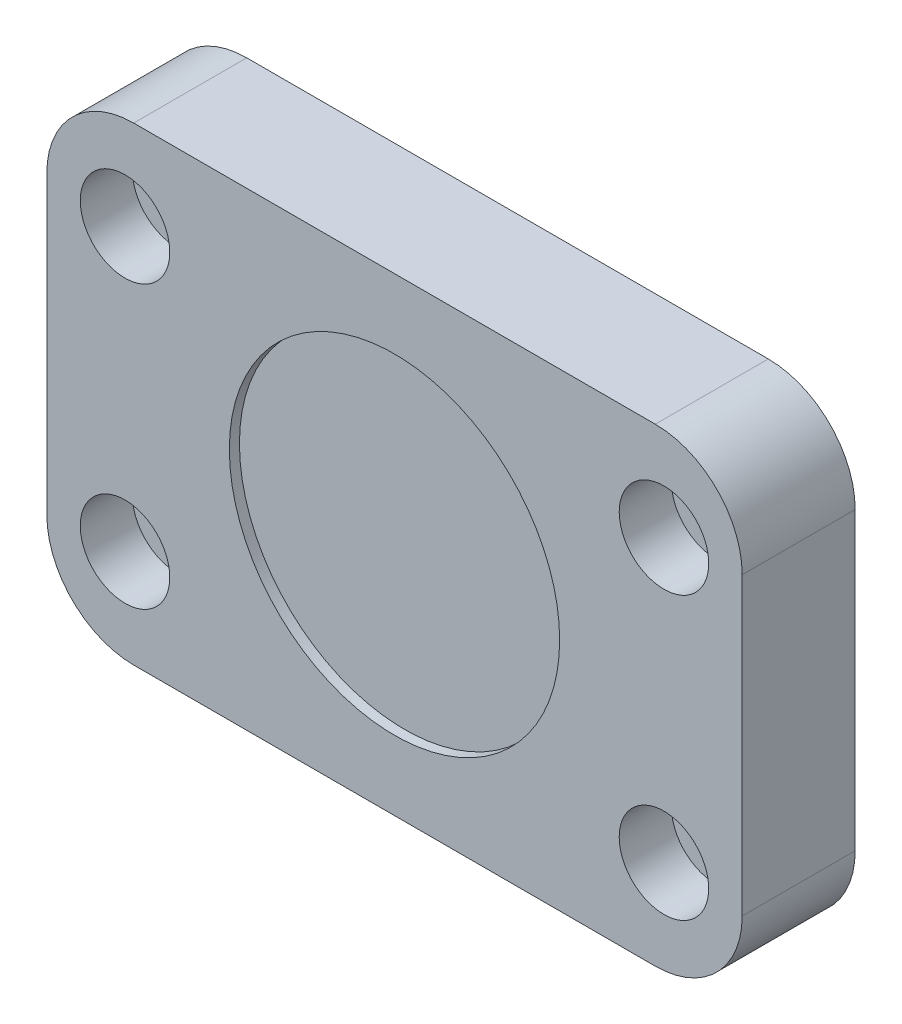
ISO-10303-21;
HEADER;
FILE_DESCRIPTION(('STEP AP214'),'2;1');
FILE_NAME('part.step','',(''),(''),'','','');
FILE_SCHEMA(('AUTOMOTIVE_DESIGN { 1 0 10303 214 1 1 1 1 }'));
ENDSEC;
DATA;
#1=APPLICATION_CONTEXT('core data for automotive mechanical design processes');
#2=APPLICATION_PROTOCOL_DEFINITION('international standard','automotive_design',2000,#1);
#3=PRODUCT_CONTEXT('',#1,'mechanical');
#4=PRODUCT('Part','Part','',(#3));
#5=PRODUCT_RELATED_PRODUCT_CATEGORY('part','',(#4));
#6=PRODUCT_DEFINITION_FORMATION('','',#4);
#7=PRODUCT_DEFINITION_CONTEXT('part definition',#1,'design');
#8=PRODUCT_DEFINITION('design','',#6,#7);
#9=PRODUCT_DEFINITION_SHAPE('','',#8);
#10=(LENGTH_UNIT() NAMED_UNIT(*) SI_UNIT(.MILLI.,.METRE.));
#11=(NAMED_UNIT(*) PLANE_ANGLE_UNIT() SI_UNIT($,.RADIAN.));
#12=(NAMED_UNIT(*) SI_UNIT($,.STERADIAN.) SOLID_ANGLE_UNIT());
#13=UNCERTAINTY_MEASURE_WITH_UNIT(LENGTH_MEASURE(1.E-05),#10,'distance_accuracy_value','');
#14=(GEOMETRIC_REPRESENTATION_CONTEXT(3) GLOBAL_UNCERTAINTY_ASSIGNED_CONTEXT((#13)) GLOBAL_UNIT_ASSIGNED_CONTEXT((#10,
#11,#12)) REPRESENTATION_CONTEXT('',''));
#15=CARTESIAN_POINT('',(0.,0.,0.));
#16=DIRECTION('',(0.,0.,1.));
#17=DIRECTION('',(1.,0.,0.));
#18=AXIS2_PLACEMENT_3D('',#15,#16,#17);
#19=CARTESIAN_POINT('',(0.,29.,50.84));
#20=DIRECTION('',(0.,0.,1.));
#21=DIRECTION('',(1.,0.,0.));
#22=AXIS2_PLACEMENT_3D('',#19,#20,#21);
#23=PLANE('',#22);
#24=CARTESIAN_POINT('',(0.,29.,50.84));
#25=DIRECTION('',(0.,0.,1.));
#26=DIRECTION('',(1.,0.,0.));
#27=AXIS2_PLACEMENT_3D('',#24,#25,#26);
#28=CIRCLE('',#27,19.);
#29=CARTESIAN_POINT('',(19.,29.,50.84));
#30=VERTEX_POINT('',#29);
#31=EDGE_CURVE('E19',#30,#30,#28,.T.);
#32=ORIENTED_EDGE('',*,*,#31,.T.);
#33=EDGE_LOOP('',(#32));
#34=FACE_BOUND('',#33,.T.);
#35=ADVANCED_FACE('F16',(#34),#23,.T.);
#36=CARTESIAN_POINT('',(0.,29.,50.84));
#37=DIRECTION('',(0.,0.,1.));
#38=DIRECTION('',(1.,0.,0.));
#39=AXIS2_PLACEMENT_3D('',#36,#37,#38);
#40=CYLINDRICAL_SURFACE('',#39,19.);
#41=CARTESIAN_POINT('',(0.,29.,52.));
#42=DIRECTION('',(0.,0.,1.));
#43=DIRECTION('',(1.,0.,0.));
#44=AXIS2_PLACEMENT_3D('',#41,#42,#43);
#45=CIRCLE('',#44,19.);
#46=CARTESIAN_POINT('',(19.,29.,52.));
#47=VERTEX_POINT('',#46);
#48=EDGE_CURVE('E180',#47,#47,#45,.F.);
#49=ORIENTED_EDGE('',*,*,#48,.F.);
#50=EDGE_LOOP('',(#49));
#51=FACE_BOUND('',#50,.T.);
#52=ORIENTED_EDGE('',*,*,#31,.F.);
#53=EDGE_LOOP('',(#52));
#54=FACE_BOUND('',#53,.T.);
#55=ADVANCED_FACE('F188',(#51,#54),#40,.F.);
#56=CARTESIAN_POINT('',(-31.,45.2,49.));
#57=DIRECTION('',(0.,0.,-1.));
#58=DIRECTION('',(-1.,0.,0.));
#59=AXIS2_PLACEMENT_3D('',#56,#57,#58);
#60=CYLINDRICAL_SURFACE('',#59,5.15);
#61=CARTESIAN_POINT('',(-31.,45.2,46.));
#62=DIRECTION('',(0.,0.,-1.));
#63=DIRECTION('',(-1.,0.,0.));
#64=AXIS2_PLACEMENT_3D('',#61,#62,#63);
#65=CIRCLE('',#64,5.15);
#66=CARTESIAN_POINT('',(-36.15,45.2,46.));
#67=VERTEX_POINT('',#66);
#68=EDGE_CURVE('E166',#67,#67,#65,.T.);
#69=ORIENTED_EDGE('',*,*,#68,.T.);
#70=EDGE_LOOP('',(#69));
#71=FACE_BOUND('',#70,.T.);
#72=CARTESIAN_POINT('',(-31.,45.2,52.));
#73=DIRECTION('',(0.,0.,-1.));
#74=DIRECTION('',(-1.,0.,0.));
#75=AXIS2_PLACEMENT_3D('',#72,#73,#74);
#76=CIRCLE('',#75,5.15);
#77=CARTESIAN_POINT('',(-36.15,45.2,52.));
#78=VERTEX_POINT('',#77);
#79=EDGE_CURVE('E178',#78,#78,#76,.T.);
#80=ORIENTED_EDGE('',*,*,#79,.F.);
#81=EDGE_LOOP('',(#80));
#82=FACE_BOUND('',#81,.T.);
#83=ADVANCED_FACE('F190',(#71,#82),#60,.F.);
#84=CARTESIAN_POINT('',(31.,45.2,49.));
#85=DIRECTION('',(0.,0.,-1.));
#86=DIRECTION('',(-1.,0.,0.));
#87=AXIS2_PLACEMENT_3D('',#84,#85,#86);
#88=CYLINDRICAL_SURFACE('',#87,5.15);
#89=CARTESIAN_POINT('',(31.,45.2,46.));
#90=DIRECTION('',(0.,0.,-1.));
#91=DIRECTION('',(-1.,0.,0.));
#92=AXIS2_PLACEMENT_3D('',#89,#90,#91);
#93=CIRCLE('',#92,5.15);
#94=CARTESIAN_POINT('',(25.85,45.2,46.));
#95=VERTEX_POINT('',#94);
#96=EDGE_CURVE('E163',#95,#95,#93,.T.);
#97=ORIENTED_EDGE('',*,*,#96,.T.);
#98=EDGE_LOOP('',(#97));
#99=FACE_BOUND('',#98,.T.);
#100=CARTESIAN_POINT('',(31.,45.2,52.));
#101=DIRECTION('',(0.,0.,-1.));
#102=DIRECTION('',(-1.,0.,0.));
#103=AXIS2_PLACEMENT_3D('',#100,#101,#102);
#104=CIRCLE('',#103,5.15);
#105=CARTESIAN_POINT('',(25.85,45.2,52.));
#106=VERTEX_POINT('',#105);
#107=EDGE_CURVE('E175',#106,#106,#104,.T.);
#108=ORIENTED_EDGE('',*,*,#107,.F.);
#109=EDGE_LOOP('',(#108));
#110=FACE_BOUND('',#109,.T.);
#111=ADVANCED_FACE('F197',(#99,#110),#88,.F.);
#112=CARTESIAN_POINT('',(31.,12.8,49.));
#113=DIRECTION('',(0.,0.,-1.));
#114=DIRECTION('',(-1.,0.,0.));
#115=AXIS2_PLACEMENT_3D('',#112,#113,#114);
#116=CYLINDRICAL_SURFACE('',#115,5.15);
#117=CARTESIAN_POINT('',(31.,12.8,46.));
#118=DIRECTION('',(0.,0.,-1.));
#119=DIRECTION('',(-1.,0.,0.));
#120=AXIS2_PLACEMENT_3D('',#117,#118,#119);
#121=CIRCLE('',#120,5.15);
#122=CARTESIAN_POINT('',(25.85,12.8,46.));
#123=VERTEX_POINT('',#122);
#124=EDGE_CURVE('E160',#123,#123,#121,.T.);
#125=ORIENTED_EDGE('',*,*,#124,.T.);
#126=EDGE_LOOP('',(#125));
#127=FACE_BOUND('',#126,.T.);
#128=CARTESIAN_POINT('',(31.,12.8,52.));
#129=DIRECTION('',(0.,0.,-1.));
#130=DIRECTION('',(-1.,0.,0.));
#131=AXIS2_PLACEMENT_3D('',#128,#129,#130);
#132=CIRCLE('',#131,5.15);
#133=CARTESIAN_POINT('',(25.85,12.8,52.));
#134=VERTEX_POINT('',#133);
#135=EDGE_CURVE('E172',#134,#134,#132,.T.);
#136=ORIENTED_EDGE('',*,*,#135,.F.);
#137=EDGE_LOOP('',(#136));
#138=FACE_BOUND('',#137,.T.);
#139=ADVANCED_FACE('F274',(#127,#138),#116,.F.);
#140=CARTESIAN_POINT('',(-31.,12.8,49.));
#141=DIRECTION('',(0.,0.,-1.));
#142=DIRECTION('',(-1.,0.,0.));
#143=AXIS2_PLACEMENT_3D('',#140,#141,#142);
#144=CYLINDRICAL_SURFACE('',#143,5.15);
#145=CARTESIAN_POINT('',(-31.,12.8,46.));
#146=DIRECTION('',(0.,0.,-1.));
#147=DIRECTION('',(-1.,0.,0.));
#148=AXIS2_PLACEMENT_3D('',#145,#146,#147);
#149=CIRCLE('',#148,5.15);
#150=CARTESIAN_POINT('',(-36.15,12.8,46.));
#151=VERTEX_POINT('',#150);
#152=EDGE_CURVE('E99',#151,#151,#149,.T.);
#153=ORIENTED_EDGE('',*,*,#152,.T.);
#154=EDGE_LOOP('',(#153));
#155=FACE_BOUND('',#154,.T.);
#156=CARTESIAN_POINT('',(-31.,12.8,52.));
#157=DIRECTION('',(0.,0.,-1.));
#158=DIRECTION('',(-1.,0.,0.));
#159=AXIS2_PLACEMENT_3D('',#156,#157,#158);
#160=CIRCLE('',#159,5.15);
#161=CARTESIAN_POINT('',(-36.15,12.8,52.));
#162=VERTEX_POINT('',#161);
#163=EDGE_CURVE('E169',#162,#162,#160,.T.);
#164=ORIENTED_EDGE('',*,*,#163,.F.);
#165=EDGE_LOOP('',(#164));
#166=FACE_BOUND('',#165,.T.);
#167=ADVANCED_FACE('F270',(#155,#166),#144,.F.);
#168=CARTESIAN_POINT('',(0.,29.,52.));
#169=DIRECTION('',(0.,0.,1.));
#170=DIRECTION('',(1.,0.,0.));
#171=AXIS2_PLACEMENT_3D('',#168,#169,#170);
#172=PLANE('',#171);
#173=ORIENTED_EDGE('',*,*,#163,.T.);
#174=EDGE_LOOP('',(#173));
#175=FACE_BOUND('',#174,.T.);
#176=ORIENTED_EDGE('',*,*,#135,.T.);
#177=EDGE_LOOP('',(#176));
#178=FACE_BOUND('',#177,.T.);
#179=ORIENTED_EDGE('',*,*,#107,.T.);
#180=EDGE_LOOP('',(#179));
#181=FACE_BOUND('',#180,.T.);
#182=ORIENTED_EDGE('',*,*,#79,.T.);
#183=EDGE_LOOP('',(#182));
#184=FACE_BOUND('',#183,.T.);
#185=ORIENTED_EDGE('',*,*,#48,.T.);
#186=EDGE_LOOP('',(#185));
#187=FACE_BOUND('',#186,.T.);
#188=DIRECTION('',(0.,1.,0.));
#189=VECTOR('',#188,1.);
#190=CARTESIAN_POINT('',(40.,12.,52.));
#191=LINE('',#190,#189);
#192=CARTESIAN_POINT('',(40.,46.,52.));
#193=VERTEX_POINT('',#192);
#194=CARTESIAN_POINT('',(40.,12.,52.));
#195=VERTEX_POINT('',#194);
#196=EDGE_CURVE('E112',#193,#195,#191,.F.);
#197=ORIENTED_EDGE('',*,*,#196,.F.);
#198=CARTESIAN_POINT('',(30.,46.,52.));
#199=DIRECTION('',(0.,0.,1.));
#200=DIRECTION('',(1.,0.,0.));
#201=AXIS2_PLACEMENT_3D('',#198,#199,#200);
#202=CIRCLE('',#201,10.);
#203=CARTESIAN_POINT('',(30.,56.,52.));
#204=VERTEX_POINT('',#203);
#205=EDGE_CURVE('E153',#204,#193,#202,.F.);
#206=ORIENTED_EDGE('',*,*,#205,.F.);
#207=DIRECTION('',(-1.,0.,0.));
#208=VECTOR('',#207,1.);
#209=CARTESIAN_POINT('',(30.,56.,52.));
#210=LINE('',#209,#208);
#211=CARTESIAN_POINT('',(-30.,56.,52.));
#212=VERTEX_POINT('',#211);
#213=EDGE_CURVE('E95',#212,#204,#210,.F.);
#214=ORIENTED_EDGE('',*,*,#213,.F.);
#215=CARTESIAN_POINT('',(-30.,46.,52.));
#216=DIRECTION('',(0.,0.,1.));
#217=DIRECTION('',(1.,0.,0.));
#218=AXIS2_PLACEMENT_3D('',#215,#216,#217);
#219=CIRCLE('',#218,10.);
#220=CARTESIAN_POINT('',(-40.,46.,52.));
#221=VERTEX_POINT('',#220);
#222=EDGE_CURVE('E88',#221,#212,#219,.F.);
#223=ORIENTED_EDGE('',*,*,#222,.F.);
#224=DIRECTION('',(0.,-1.,0.));
#225=VECTOR('',#224,1.);
#226=CARTESIAN_POINT('',(-40.,46.,52.));
#227=LINE('',#226,#225);
#228=CARTESIAN_POINT('',(-40.,12.,52.));
#229=VERTEX_POINT('',#228);
#230=EDGE_CURVE('E78',#229,#221,#227,.F.);
#231=ORIENTED_EDGE('',*,*,#230,.F.);
#232=CARTESIAN_POINT('',(-30.,12.,52.));
#233=DIRECTION('',(0.,0.,1.));
#234=DIRECTION('',(1.,0.,0.));
#235=AXIS2_PLACEMENT_3D('',#232,#233,#234);
#236=CIRCLE('',#235,10.);
#237=CARTESIAN_POINT('',(-30.,2.00000000000001,52.));
#238=VERTEX_POINT('',#237);
#239=EDGE_CURVE('E104',#238,#229,#236,.F.);
#240=ORIENTED_EDGE('',*,*,#239,.F.);
#241=DIRECTION('',(1.,0.,0.));
#242=VECTOR('',#241,1.);
#243=CARTESIAN_POINT('',(-30.,2.00000000000001,52.));
#244=LINE('',#243,#242);
#245=CARTESIAN_POINT('',(30.,2.00000000000001,52.));
#246=VERTEX_POINT('',#245);
#247=EDGE_CURVE('E116',#246,#238,#244,.F.);
#248=ORIENTED_EDGE('',*,*,#247,.F.);
#249=CARTESIAN_POINT('',(30.,12.,52.));
#250=DIRECTION('',(0.,0.,1.));
#251=DIRECTION('',(1.,0.,0.));
#252=AXIS2_PLACEMENT_3D('',#249,#250,#251);
#253=CIRCLE('',#252,10.);
#254=EDGE_CURVE('E156',#195,#246,#253,.F.);
#255=ORIENTED_EDGE('',*,*,#254,.F.);
#256=EDGE_LOOP('',(#197,#206,#214,#223,#231,#240,#248,#255));
#257=FACE_BOUND('',#256,.T.);
#258=ADVANCED_FACE('F93',(#175,#178,#181,#184,#187,#257),#172,.T.);
#259=CARTESIAN_POINT('',(-31.,45.2,46.));
#260=DIRECTION('',(0.,0.,-1.));
#261=DIRECTION('',(-1.,0.,0.));
#262=AXIS2_PLACEMENT_3D('',#259,#260,#261);
#263=PLANE('',#262);
#264=CARTESIAN_POINT('',(-31.,45.2,46.));
#265=DIRECTION('',(0.,0.,-1.));
#266=DIRECTION('',(-1.,0.,0.));
#267=AXIS2_PLACEMENT_3D('',#264,#265,#266);
#268=CIRCLE('',#267,3.3);
#269=CARTESIAN_POINT('',(-34.3,45.2,46.));
#270=VERTEX_POINT('',#269);
#271=EDGE_CURVE('E150',#270,#270,#268,.T.);
#272=ORIENTED_EDGE('',*,*,#271,.T.);
#273=EDGE_LOOP('',(#272));
#274=FACE_BOUND('',#273,.T.);
#275=ORIENTED_EDGE('',*,*,#68,.F.);
#276=EDGE_LOOP('',(#275));
#277=FACE_BOUND('',#276,.T.);
#278=ADVANCED_FACE('F263',(#274,#277),#263,.F.);
#279=CARTESIAN_POINT('',(31.,45.2,46.));
#280=DIRECTION('',(0.,0.,-1.));
#281=DIRECTION('',(-1.,0.,0.));
#282=AXIS2_PLACEMENT_3D('',#279,#280,#281);
#283=PLANE('',#282);
#284=CARTESIAN_POINT('',(31.,45.2,46.));
#285=DIRECTION('',(0.,0.,-1.));
#286=DIRECTION('',(-1.,0.,0.));
#287=AXIS2_PLACEMENT_3D('',#284,#285,#286);
#288=CIRCLE('',#287,3.3);
#289=CARTESIAN_POINT('',(27.7,45.2,46.));
#290=VERTEX_POINT('',#289);
#291=EDGE_CURVE('E147',#290,#290,#288,.T.);
#292=ORIENTED_EDGE('',*,*,#291,.T.);
#293=EDGE_LOOP('',(#292));
#294=FACE_BOUND('',#293,.T.);
#295=ORIENTED_EDGE('',*,*,#96,.F.);
#296=EDGE_LOOP('',(#295));
#297=FACE_BOUND('',#296,.T.);
#298=ADVANCED_FACE('F259',(#294,#297),#283,.F.);
#299=CARTESIAN_POINT('',(31.,12.8,46.));
#300=DIRECTION('',(0.,0.,-1.));
#301=DIRECTION('',(-1.,0.,0.));
#302=AXIS2_PLACEMENT_3D('',#299,#300,#301);
#303=PLANE('',#302);
#304=CARTESIAN_POINT('',(31.,12.8,46.));
#305=DIRECTION('',(0.,0.,-1.));
#306=DIRECTION('',(-1.,0.,0.));
#307=AXIS2_PLACEMENT_3D('',#304,#305,#306);
#308=CIRCLE('',#307,3.3);
#309=CARTESIAN_POINT('',(27.7,12.8,46.));
#310=VERTEX_POINT('',#309);
#311=EDGE_CURVE('E144',#310,#310,#308,.T.);
#312=ORIENTED_EDGE('',*,*,#311,.T.);
#313=EDGE_LOOP('',(#312));
#314=FACE_BOUND('',#313,.T.);
#315=ORIENTED_EDGE('',*,*,#124,.F.);
#316=EDGE_LOOP('',(#315));
#317=FACE_BOUND('',#316,.T.);
#318=ADVANCED_FACE('F255',(#314,#317),#303,.F.);
#319=CARTESIAN_POINT('',(-31.,12.8,46.));
#320=DIRECTION('',(0.,0.,-1.));
#321=DIRECTION('',(-1.,0.,0.));
#322=AXIS2_PLACEMENT_3D('',#319,#320,#321);
#323=PLANE('',#322);
#324=CARTESIAN_POINT('',(-31.,12.8,46.));
#325=DIRECTION('',(0.,0.,-1.));
#326=DIRECTION('',(-1.,0.,0.));
#327=AXIS2_PLACEMENT_3D('',#324,#325,#326);
#328=CIRCLE('',#327,3.3);
#329=CARTESIAN_POINT('',(-34.3,12.8,46.));
#330=VERTEX_POINT('',#329);
#331=EDGE_CURVE('E141',#330,#330,#328,.T.);
#332=ORIENTED_EDGE('',*,*,#331,.T.);
#333=EDGE_LOOP('',(#332));
#334=FACE_BOUND('',#333,.T.);
#335=ORIENTED_EDGE('',*,*,#152,.F.);
#336=EDGE_LOOP('',(#335));
#337=FACE_BOUND('',#336,.T.);
#338=ADVANCED_FACE('F252',(#334,#337),#323,.F.);
#339=CARTESIAN_POINT('',(-30.,46.,39.));
#340=DIRECTION('',(0.,0.,1.));
#341=DIRECTION('',(1.,0.,0.));
#342=AXIS2_PLACEMENT_3D('',#339,#340,#341);
#343=CYLINDRICAL_SURFACE('',#342,10.);
#344=ORIENTED_EDGE('',*,*,#222,.T.);
#345=DIRECTION('',(0.,0.,1.));
#346=VECTOR('',#345,1.);
#347=CARTESIAN_POINT('',(-30.,56.,39.));
#348=LINE('',#347,#346);
#349=CARTESIAN_POINT('',(-30.,56.,39.));
#350=VERTEX_POINT('',#349);
#351=EDGE_CURVE('E111',#350,#212,#348,.T.);
#352=ORIENTED_EDGE('',*,*,#351,.F.);
#353=CARTESIAN_POINT('',(-30.,46.,39.));
#354=DIRECTION('',(0.,0.,1.));
#355=DIRECTION('',(1.,0.,0.));
#356=AXIS2_PLACEMENT_3D('',#353,#354,#355);
#357=CIRCLE('',#356,10.);
#358=CARTESIAN_POINT('',(-40.,46.,39.));
#359=VERTEX_POINT('',#358);
#360=EDGE_CURVE('E103',#350,#359,#357,.T.);
#361=ORIENTED_EDGE('',*,*,#360,.T.);
#362=DIRECTION('',(0.,0.,1.));
#363=VECTOR('',#362,1.);
#364=CARTESIAN_POINT('',(-40.,46.,39.));
#365=LINE('',#364,#363);
#366=EDGE_CURVE('E83',#221,#359,#365,.F.);
#367=ORIENTED_EDGE('',*,*,#366,.F.);
#368=EDGE_LOOP('',(#344,#352,#361,#367));
#369=FACE_BOUND('',#368,.T.);
#370=ADVANCED_FACE('F102',(#369),#343,.T.);
#371=CARTESIAN_POINT('',(-40.,46.,39.));
#372=DIRECTION('',(-1.,0.,0.));
#373=DIRECTION('',(0.,-1.,0.));
#374=AXIS2_PLACEMENT_3D('',#371,#372,#373);
#375=PLANE('',#374);
#376=ORIENTED_EDGE('',*,*,#230,.T.);
#377=ORIENTED_EDGE('',*,*,#366,.T.);
#378=DIRECTION('',(0.,1.,0.));
#379=VECTOR('',#378,1.);
#380=CARTESIAN_POINT('',(-40.,29.,39.));
#381=LINE('',#380,#379);
#382=CARTESIAN_POINT('',(-40.,12.,39.));
#383=VERTEX_POINT('',#382);
#384=EDGE_CURVE('E139',#359,#383,#381,.F.);
#385=ORIENTED_EDGE('',*,*,#384,.T.);
#386=DIRECTION('',(0.,0.,1.));
#387=VECTOR('',#386,1.);
#388=CARTESIAN_POINT('',(-40.,12.,39.));
#389=LINE('',#388,#387);
#390=EDGE_CURVE('E85',#229,#383,#389,.F.);
#391=ORIENTED_EDGE('',*,*,#390,.F.);
#392=EDGE_LOOP('',(#376,#377,#385,#391));
#393=FACE_BOUND('',#392,.T.);
#394=ADVANCED_FACE('F80',(#393),#375,.T.);
#395=CARTESIAN_POINT('',(-30.,12.,39.));
#396=DIRECTION('',(0.,0.,1.));
#397=DIRECTION('',(1.,0.,0.));
#398=AXIS2_PLACEMENT_3D('',#395,#396,#397);
#399=CYLINDRICAL_SURFACE('',#398,10.);
#400=ORIENTED_EDGE('',*,*,#239,.T.);
#401=ORIENTED_EDGE('',*,*,#390,.T.);
#402=CARTESIAN_POINT('',(-30.,12.,39.));
#403=DIRECTION('',(0.,0.,1.));
#404=DIRECTION('',(1.,0.,0.));
#405=AXIS2_PLACEMENT_3D('',#402,#403,#404);
#406=CIRCLE('',#405,10.);
#407=CARTESIAN_POINT('',(-30.,2.,39.));
#408=VERTEX_POINT('',#407);
#409=EDGE_CURVE('E136',#383,#408,#406,.T.);
#410=ORIENTED_EDGE('',*,*,#409,.T.);
#411=DIRECTION('',(0.,0.,1.));
#412=VECTOR('',#411,1.);
#413=CARTESIAN_POINT('',(-30.,2.00000000000001,39.));
#414=LINE('',#413,#412);
#415=EDGE_CURVE('E117',#238,#408,#414,.F.);
#416=ORIENTED_EDGE('',*,*,#415,.F.);
#417=EDGE_LOOP('',(#400,#401,#410,#416));
#418=FACE_BOUND('',#417,.T.);
#419=ADVANCED_FACE('F243',(#418),#399,.T.);
#420=CARTESIAN_POINT('',(-30.,2.00000000000001,39.));
#421=DIRECTION('',(0.,-1.,0.));
#422=DIRECTION('',(1.,0.,0.));
#423=AXIS2_PLACEMENT_3D('',#420,#421,#422);
#424=PLANE('',#423);
#425=ORIENTED_EDGE('',*,*,#247,.T.);
#426=ORIENTED_EDGE('',*,*,#415,.T.);
#427=DIRECTION('',(1.,0.,0.));
#428=VECTOR('',#427,1.);
#429=CARTESIAN_POINT('',(0.,2.,39.));
#430=LINE('',#429,#428);
#431=CARTESIAN_POINT('',(30.,2.,39.));
#432=VERTEX_POINT('',#431);
#433=EDGE_CURVE('E135',#408,#432,#430,.T.);
#434=ORIENTED_EDGE('',*,*,#433,.T.);
#435=DIRECTION('',(0.,0.,1.));
#436=VECTOR('',#435,1.);
#437=CARTESIAN_POINT('',(30.,2.,39.));
#438=LINE('',#437,#436);
#439=EDGE_CURVE('E115',#246,#432,#438,.F.);
#440=ORIENTED_EDGE('',*,*,#439,.F.);
#441=EDGE_LOOP('',(#425,#426,#434,#440));
#442=FACE_BOUND('',#441,.T.);
#443=ADVANCED_FACE('F239',(#442),#424,.T.);
#444=CARTESIAN_POINT('',(30.,12.,39.));
#445=DIRECTION('',(0.,0.,1.));
#446=DIRECTION('',(1.,0.,0.));
#447=AXIS2_PLACEMENT_3D('',#444,#445,#446);
#448=CYLINDRICAL_SURFACE('',#447,10.);
#449=ORIENTED_EDGE('',*,*,#254,.T.);
#450=ORIENTED_EDGE('',*,*,#439,.T.);
#451=CARTESIAN_POINT('',(30.,12.,39.));
#452=DIRECTION('',(0.,0.,1.));
#453=DIRECTION('',(1.,0.,0.));
#454=AXIS2_PLACEMENT_3D('',#451,#452,#453);
#455=CIRCLE('',#454,10.);
#456=CARTESIAN_POINT('',(40.,12.,39.));
#457=VERTEX_POINT('',#456);
#458=EDGE_CURVE('E132',#432,#457,#455,.T.);
#459=ORIENTED_EDGE('',*,*,#458,.T.);
#460=DIRECTION('',(0.,0.,-1.));
#461=VECTOR('',#460,1.);
#462=CARTESIAN_POINT('',(40.,12.,39.));
#463=LINE('',#462,#461);
#464=EDGE_CURVE('E114',#195,#457,#463,.T.);
#465=ORIENTED_EDGE('',*,*,#464,.F.);
#466=EDGE_LOOP('',(#449,#450,#459,#465));
#467=FACE_BOUND('',#466,.T.);
#468=ADVANCED_FACE('F235',(#467),#448,.T.);
#469=CARTESIAN_POINT('',(40.,12.,39.));
#470=DIRECTION('',(1.,0.,0.));
#471=DIRECTION('',(0.,0.,-1.));
#472=AXIS2_PLACEMENT_3D('',#469,#470,#471);
#473=PLANE('',#472);
#474=ORIENTED_EDGE('',*,*,#196,.T.);
#475=ORIENTED_EDGE('',*,*,#464,.T.);
#476=DIRECTION('',(0.,1.,0.));
#477=VECTOR('',#476,1.);
#478=CARTESIAN_POINT('',(40.,29.,39.));
#479=LINE('',#478,#477);
#480=CARTESIAN_POINT('',(40.,46.,39.));
#481=VERTEX_POINT('',#480);
#482=EDGE_CURVE('E131',#457,#481,#479,.T.);
#483=ORIENTED_EDGE('',*,*,#482,.T.);
#484=DIRECTION('',(0.,0.,1.));
#485=VECTOR('',#484,1.);
#486=CARTESIAN_POINT('',(40.,46.,39.));
#487=LINE('',#486,#485);
#488=EDGE_CURVE('E155',#193,#481,#487,.F.);
#489=ORIENTED_EDGE('',*,*,#488,.F.);
#490=EDGE_LOOP('',(#474,#475,#483,#489));
#491=FACE_BOUND('',#490,.T.);
#492=ADVANCED_FACE('F231',(#491),#473,.T.);
#493=CARTESIAN_POINT('',(30.,46.,39.));
#494=DIRECTION('',(0.,0.,1.));
#495=DIRECTION('',(1.,0.,0.));
#496=AXIS2_PLACEMENT_3D('',#493,#494,#495);
#497=CYLINDRICAL_SURFACE('',#496,10.);
#498=ORIENTED_EDGE('',*,*,#205,.T.);
#499=ORIENTED_EDGE('',*,*,#488,.T.);
#500=CARTESIAN_POINT('',(30.,46.,39.));
#501=DIRECTION('',(0.,0.,1.));
#502=DIRECTION('',(1.,0.,0.));
#503=AXIS2_PLACEMENT_3D('',#500,#501,#502);
#504=CIRCLE('',#503,10.);
#505=CARTESIAN_POINT('',(30.,56.,39.));
#506=VERTEX_POINT('',#505);
#507=EDGE_CURVE('E128',#481,#506,#504,.T.);
#508=ORIENTED_EDGE('',*,*,#507,.T.);
#509=DIRECTION('',(0.,0.,1.));
#510=VECTOR('',#509,1.);
#511=CARTESIAN_POINT('',(30.,56.,39.));
#512=LINE('',#511,#510);
#513=EDGE_CURVE('E34',#204,#506,#512,.F.);
#514=ORIENTED_EDGE('',*,*,#513,.F.);
#515=EDGE_LOOP('',(#498,#499,#508,#514));
#516=FACE_BOUND('',#515,.T.);
#517=ADVANCED_FACE('F228',(#516),#497,.T.);
#518=CARTESIAN_POINT('',(30.,56.,39.));
#519=DIRECTION('',(0.,1.,0.));
#520=DIRECTION('',(-1.,0.,0.));
#521=AXIS2_PLACEMENT_3D('',#518,#519,#520);
#522=PLANE('',#521);
#523=ORIENTED_EDGE('',*,*,#213,.T.);
#524=ORIENTED_EDGE('',*,*,#513,.T.);
#525=DIRECTION('',(1.,0.,0.));
#526=VECTOR('',#525,1.);
#527=CARTESIAN_POINT('',(0.,56.,39.));
#528=LINE('',#527,#526);
#529=EDGE_CURVE('E127',#506,#350,#528,.F.);
#530=ORIENTED_EDGE('',*,*,#529,.T.);
#531=ORIENTED_EDGE('',*,*,#351,.T.);
#532=EDGE_LOOP('',(#523,#524,#530,#531));
#533=FACE_BOUND('',#532,.T.);
#534=ADVANCED_FACE('F224',(#533),#522,.T.);
#535=CARTESIAN_POINT('',(-31.,45.2,23.4));
#536=DIRECTION('',(0.,0.,-1.));
#537=DIRECTION('',(-1.,0.,0.));
#538=AXIS2_PLACEMENT_3D('',#535,#536,#537);
#539=CYLINDRICAL_SURFACE('',#538,3.3);
#540=CARTESIAN_POINT('',(-31.,45.2,39.));
#541=DIRECTION('',(0.,0.,-1.));
#542=DIRECTION('',(-1.,0.,0.));
#543=AXIS2_PLACEMENT_3D('',#540,#541,#542);
#544=CIRCLE('',#543,3.3);
#545=CARTESIAN_POINT('',(-34.3,45.2,39.));
#546=VERTEX_POINT('',#545);
#547=EDGE_CURVE('E124',#546,#546,#544,.T.);
#548=ORIENTED_EDGE('',*,*,#547,.T.);
#549=EDGE_LOOP('',(#548));
#550=FACE_BOUND('',#549,.T.);
#551=ORIENTED_EDGE('',*,*,#271,.F.);
#552=EDGE_LOOP('',(#551));
#553=FACE_BOUND('',#552,.T.);
#554=ADVANCED_FACE('F220',(#550,#553),#539,.F.);
#555=CARTESIAN_POINT('',(31.,45.2,23.4));
#556=DIRECTION('',(0.,0.,-1.));
#557=DIRECTION('',(-1.,0.,0.));
#558=AXIS2_PLACEMENT_3D('',#555,#556,#557);
#559=CYLINDRICAL_SURFACE('',#558,3.3);
#560=CARTESIAN_POINT('',(31.,45.2,39.));
#561=DIRECTION('',(0.,0.,-1.));
#562=DIRECTION('',(-1.,0.,0.));
#563=AXIS2_PLACEMENT_3D('',#560,#561,#562);
#564=CIRCLE('',#563,3.3);
#565=CARTESIAN_POINT('',(27.7,45.2,39.));
#566=VERTEX_POINT('',#565);
#567=EDGE_CURVE('E121',#566,#566,#564,.T.);
#568=ORIENTED_EDGE('',*,*,#567,.T.);
#569=EDGE_LOOP('',(#568));
#570=FACE_BOUND('',#569,.T.);
#571=ORIENTED_EDGE('',*,*,#291,.F.);
#572=EDGE_LOOP('',(#571));
#573=FACE_BOUND('',#572,.T.);
#574=ADVANCED_FACE('F216',(#570,#573),#559,.F.);
#575=CARTESIAN_POINT('',(31.,12.8,23.4));
#576=DIRECTION('',(0.,0.,-1.));
#577=DIRECTION('',(-1.,0.,0.));
#578=AXIS2_PLACEMENT_3D('',#575,#576,#577);
#579=CYLINDRICAL_SURFACE('',#578,3.3);
#580=CARTESIAN_POINT('',(31.,12.8,39.));
#581=DIRECTION('',(0.,0.,-1.));
#582=DIRECTION('',(-1.,0.,0.));
#583=AXIS2_PLACEMENT_3D('',#580,#581,#582);
#584=CIRCLE('',#583,3.3);
#585=CARTESIAN_POINT('',(27.7,12.8,39.));
#586=VERTEX_POINT('',#585);
#587=EDGE_CURVE('E25',#586,#586,#584,.T.);
#588=ORIENTED_EDGE('',*,*,#587,.T.);
#589=EDGE_LOOP('',(#588));
#590=FACE_BOUND('',#589,.T.);
#591=ORIENTED_EDGE('',*,*,#311,.F.);
#592=EDGE_LOOP('',(#591));
#593=FACE_BOUND('',#592,.T.);
#594=ADVANCED_FACE('F208',(#590,#593),#579,.F.);
#595=CARTESIAN_POINT('',(-31.,12.8,23.4));
#596=DIRECTION('',(0.,0.,-1.));
#597=DIRECTION('',(-1.,0.,0.));
#598=AXIS2_PLACEMENT_3D('',#595,#596,#597);
#599=CYLINDRICAL_SURFACE('',#598,3.3);
#600=CARTESIAN_POINT('',(-31.,12.8,39.));
#601=DIRECTION('',(0.,0.,-1.));
#602=DIRECTION('',(-1.,0.,0.));
#603=AXIS2_PLACEMENT_3D('',#600,#601,#602);
#604=CIRCLE('',#603,3.3);
#605=CARTESIAN_POINT('',(-34.3,12.8,39.));
#606=VERTEX_POINT('',#605);
#607=EDGE_CURVE('E11',#606,#606,#604,.T.);
#608=ORIENTED_EDGE('',*,*,#607,.T.);
#609=EDGE_LOOP('',(#608));
#610=FACE_BOUND('',#609,.T.);
#611=ORIENTED_EDGE('',*,*,#331,.F.);
#612=EDGE_LOOP('',(#611));
#613=FACE_BOUND('',#612,.T.);
#614=ADVANCED_FACE('F202',(#610,#613),#599,.F.);
#615=CARTESIAN_POINT('',(0.,29.,39.));
#616=DIRECTION('',(0.,0.,1.));
#617=DIRECTION('',(1.,0.,0.));
#618=AXIS2_PLACEMENT_3D('',#615,#616,#617);
#619=PLANE('',#618);
#620=ORIENTED_EDGE('',*,*,#607,.F.);
#621=EDGE_LOOP('',(#620));
#622=FACE_BOUND('',#621,.T.);
#623=ORIENTED_EDGE('',*,*,#587,.F.);
#624=EDGE_LOOP('',(#623));
#625=FACE_BOUND('',#624,.T.);
#626=ORIENTED_EDGE('',*,*,#567,.F.);
#627=EDGE_LOOP('',(#626));
#628=FACE_BOUND('',#627,.T.);
#629=ORIENTED_EDGE('',*,*,#547,.F.);
#630=EDGE_LOOP('',(#629));
#631=FACE_BOUND('',#630,.T.);
#632=ORIENTED_EDGE('',*,*,#507,.F.);
#633=ORIENTED_EDGE('',*,*,#482,.F.);
#634=ORIENTED_EDGE('',*,*,#458,.F.);
#635=ORIENTED_EDGE('',*,*,#433,.F.);
#636=ORIENTED_EDGE('',*,*,#409,.F.);
#637=ORIENTED_EDGE('',*,*,#384,.F.);
#638=ORIENTED_EDGE('',*,*,#360,.F.);
#639=ORIENTED_EDGE('',*,*,#529,.F.);
#640=EDGE_LOOP('',(#632,#633,#634,#635,#636,#637,#638,#639));
#641=FACE_BOUND('',#640,.T.);
#642=ADVANCED_FACE('F200',(#622,#625,#628,#631,#641),#619,.F.);
#643=CLOSED_SHELL('',(#35,#55,#83,#111,#139,#167,#258,#278,#298,#318,#338,#370,#394,#419,#443,
#468,#492,#517,#534,#554,#574,#594,#614,#642));
#644=MANIFOLD_SOLID_BREP('B1',#643);
#645=ADVANCED_BREP_SHAPE_REPRESENTATION('',(#18,#644),#14);
#646=SHAPE_DEFINITION_REPRESENTATION(#9,#645);
ENDSEC;
END-ISO-10303-21;
